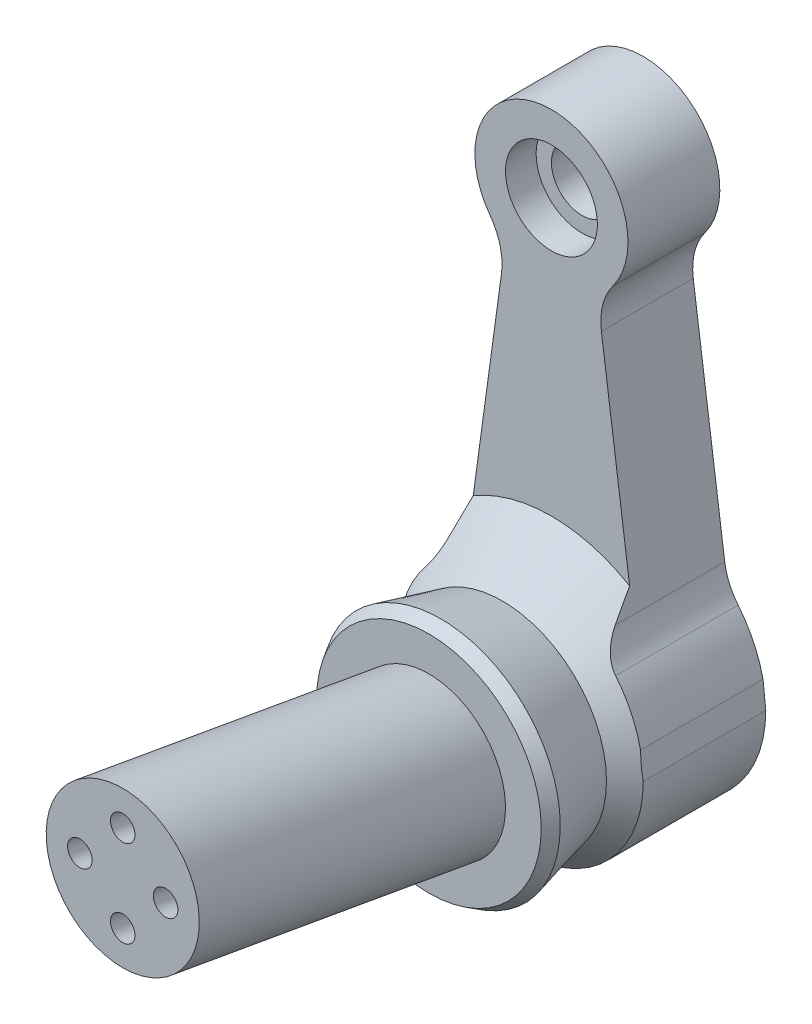
ISO-10303-21;
HEADER;
FILE_DESCRIPTION(('STEP AP214'),'2;1');
FILE_NAME('part.step','',(''),(''),'','','');
FILE_SCHEMA(('AUTOMOTIVE_DESIGN { 1 0 10303 214 1 1 1 1 }'));
ENDSEC;
DATA;
#1=APPLICATION_CONTEXT('core data for automotive mechanical design processes');
#2=APPLICATION_PROTOCOL_DEFINITION('international standard','automotive_design',2000,#1);
#3=PRODUCT_CONTEXT('',#1,'mechanical');
#4=PRODUCT('Part','Part','',(#3));
#5=PRODUCT_RELATED_PRODUCT_CATEGORY('part','',(#4));
#6=PRODUCT_DEFINITION_FORMATION('','',#4);
#7=PRODUCT_DEFINITION_CONTEXT('part definition',#1,'design');
#8=PRODUCT_DEFINITION('design','',#6,#7);
#9=PRODUCT_DEFINITION_SHAPE('','',#8);
#10=(LENGTH_UNIT() NAMED_UNIT(*) SI_UNIT(.MILLI.,.METRE.));
#11=(NAMED_UNIT(*) PLANE_ANGLE_UNIT() SI_UNIT($,.RADIAN.));
#12=(NAMED_UNIT(*) SI_UNIT($,.STERADIAN.) SOLID_ANGLE_UNIT());
#13=UNCERTAINTY_MEASURE_WITH_UNIT(LENGTH_MEASURE(1.E-05),#10,'distance_accuracy_value','');
#14=(GEOMETRIC_REPRESENTATION_CONTEXT(3) GLOBAL_UNCERTAINTY_ASSIGNED_CONTEXT((#13)) GLOBAL_UNIT_ASSIGNED_CONTEXT((#10,
#11,#12)) REPRESENTATION_CONTEXT('',''));
#15=CARTESIAN_POINT('',(0.,0.,0.));
#16=DIRECTION('',(0.,0.,1.));
#17=DIRECTION('',(1.,0.,0.));
#18=AXIS2_PLACEMENT_3D('',#15,#16,#17);
#19=CARTESIAN_POINT('',(0.,0.,-15.));
#20=DIRECTION('',(0.,0.,1.));
#21=DIRECTION('',(-1.,0.,0.));
#22=AXIS2_PLACEMENT_3D('',#19,#20,#21);
#23=CYLINDRICAL_SURFACE('',#22,4.);
#24=CARTESIAN_POINT('',(0.,0.,-15.));
#25=DIRECTION('',(0.,0.,1.));
#26=DIRECTION('',(1.,0.,0.));
#27=AXIS2_PLACEMENT_3D('',#24,#25,#26);
#28=CIRCLE('',#27,4.);
#29=CARTESIAN_POINT('',(4.,0.,-15.));
#30=VERTEX_POINT('',#29);
#31=EDGE_CURVE('E198',#30,#30,#28,.T.);
#32=ORIENTED_EDGE('',*,*,#31,.F.);
#33=EDGE_LOOP('',(#32));
#34=FACE_BOUND('',#33,.T.);
#35=CARTESIAN_POINT('',(0.,0.,-8.35500811345851));
#36=DIRECTION('',(0.,-0.173648177666931,-0.984807753012208));
#37=DIRECTION('',(0.,-0.984807753012208,0.173648177666931));
#38=AXIS2_PLACEMENT_3D('',#35,#36,#37);
#39=ELLIPSE('',#38,4.06170644754298,4.);
#40=CARTESIAN_POINT('',(0.,-4.,-7.64970019062464));
#41=VERTEX_POINT('',#40);
#42=EDGE_CURVE('E387',#41,#41,#39,.T.);
#43=ORIENTED_EDGE('',*,*,#42,.F.);
#44=EDGE_LOOP('',(#43));
#45=FACE_BOUND('',#44,.T.);
#46=ADVANCED_FACE('F39',(#34,#45),#23,.F.);
#47=CARTESIAN_POINT('',(0.,70.,-15.));
#48=DIRECTION('',(0.,0.,1.));
#49=DIRECTION('',(-1.,0.,0.));
#50=AXIS2_PLACEMENT_3D('',#47,#48,#49);
#51=CYLINDRICAL_SURFACE('',#50,5.);
#52=CARTESIAN_POINT('',(0.,70.,-5.));
#53=DIRECTION('',(0.,0.,-1.));
#54=DIRECTION('',(-1.,0.,0.));
#55=AXIS2_PLACEMENT_3D('',#52,#53,#54);
#56=CIRCLE('',#55,5.);
#57=CARTESIAN_POINT('',(-5.,70.,-5.));
#58=VERTEX_POINT('',#57);
#59=EDGE_CURVE('E203',#58,#58,#56,.T.);
#60=ORIENTED_EDGE('',*,*,#59,.F.);
#61=EDGE_LOOP('',(#60));
#62=FACE_BOUND('',#61,.T.);
#63=CARTESIAN_POINT('',(0.,70.,-10.));
#64=DIRECTION('',(0.,0.,1.));
#65=DIRECTION('',(1.,0.,0.));
#66=AXIS2_PLACEMENT_3D('',#63,#64,#65);
#67=CIRCLE('',#66,5.);
#68=CARTESIAN_POINT('',(5.,70.,-10.));
#69=VERTEX_POINT('',#68);
#70=EDGE_CURVE('E241',#69,#69,#67,.T.);
#71=ORIENTED_EDGE('',*,*,#70,.F.);
#72=EDGE_LOOP('',(#71));
#73=FACE_BOUND('',#72,.T.);
#74=ADVANCED_FACE('F339',(#62,#73),#51,.F.);
#75=CARTESIAN_POINT('',(-18.1547804490243,56.5584524287138,-15.));
#76=DIRECTION('',(0.,0.,1.));
#77=DIRECTION('',(-1.,0.,0.));
#78=AXIS2_PLACEMENT_3D('',#75,#76,#77);
#79=CYLINDRICAL_SURFACE('',#78,10.0891844532605);
#80=CARTESIAN_POINT('',(-18.1547804490243,56.5584524287138,0.));
#81=DIRECTION('',(0.,0.,1.));
#82=DIRECTION('',(1.,0.,0.));
#83=AXIS2_PLACEMENT_3D('',#80,#81,#82);
#84=CIRCLE('',#83,10.0891844532605);
#85=CARTESIAN_POINT('',(-8.15892713747916,55.1893068900712,0.));
#86=VERTEX_POINT('',#85);
#87=CARTESIAN_POINT('',(-10.0461686026052,62.5619561437143,0.));
#88=VERTEX_POINT('',#87);
#89=EDGE_CURVE('E201',#86,#88,#84,.T.);
#90=ORIENTED_EDGE('',*,*,#89,.T.);
#91=DIRECTION('',(0.,0.,1.));
#92=VECTOR('',#91,1.);
#93=CARTESIAN_POINT('',(-10.0461686026052,62.5619561437143,-15.));
#94=LINE('',#93,#92);
#95=CARTESIAN_POINT('',(-10.0461686026052,62.5619561437143,-15.));
#96=VERTEX_POINT('',#95);
#97=EDGE_CURVE('E166',#96,#88,#94,.T.);
#98=ORIENTED_EDGE('',*,*,#97,.F.);
#99=CARTESIAN_POINT('',(-18.1547804490243,56.5584524287138,-15.));
#100=DIRECTION('',(0.,0.,1.));
#101=DIRECTION('',(1.,0.,0.));
#102=AXIS2_PLACEMENT_3D('',#99,#100,#101);
#103=CIRCLE('',#102,10.0891844532605);
#104=CARTESIAN_POINT('',(-8.15892713747916,55.1893068900712,-15.));
#105=VERTEX_POINT('',#104);
#106=EDGE_CURVE('E144',#105,#96,#103,.T.);
#107=ORIENTED_EDGE('',*,*,#106,.F.);
#108=DIRECTION('',(0.,0.,1.));
#109=VECTOR('',#108,1.);
#110=CARTESIAN_POINT('',(-8.15892713747916,55.1893068900712,-15.));
#111=LINE('',#110,#109);
#112=EDGE_CURVE('E153',#105,#86,#111,.T.);
#113=ORIENTED_EDGE('',*,*,#112,.T.);
#114=EDGE_LOOP('',(#90,#98,#107,#113));
#115=FACE_BOUND('',#114,.T.);
#116=ADVANCED_FACE('F164',(#115),#79,.F.);
#117=CARTESIAN_POINT('',(-15.4288186971367,2.11330615079281,-15.));
#118=DIRECTION('',(-0.990749386915492,0.135704282639038,0.));
#119=DIRECTION('',(-0.135704282639038,-0.990749386915492,0.));
#120=AXIS2_PLACEMENT_3D('',#117,#118,#119);
#121=PLANE('',#120);
#122=DIRECTION('',(0.135704282639038,0.990749386915492,0.));
#123=VECTOR('',#122,1.);
#124=CARTESIAN_POINT('',(-15.4288186971367,2.11330615079281,0.));
#125=LINE('',#124,#123);
#126=CARTESIAN_POINT('',(-12.7748179780088,21.4896260002064,0.));
#127=VERTEX_POINT('',#126);
#128=EDGE_CURVE('E157',#127,#86,#125,.T.);
#129=ORIENTED_EDGE('',*,*,#128,.T.);
#130=ORIENTED_EDGE('',*,*,#112,.F.);
#131=DIRECTION('',(0.135704282639038,0.990749386915492,0.));
#132=VECTOR('',#131,1.);
#133=CARTESIAN_POINT('',(-15.4288186971367,2.11330615079281,-15.));
#134=LINE('',#133,#132);
#135=CARTESIAN_POINT('',(-13.2968460909897,17.6784048446871,-15.));
#136=VERTEX_POINT('',#135);
#137=EDGE_CURVE('E139',#136,#105,#134,.T.);
#138=ORIENTED_EDGE('',*,*,#137,.F.);
#139=DIRECTION('',(0.,0.,1.));
#140=VECTOR('',#139,1.);
#141=CARTESIAN_POINT('',(-13.2968460909897,17.6784048446871,-15.));
#142=LINE('',#141,#140);
#143=CARTESIAN_POINT('',(-13.2968460909897,17.6784048446871,2.87914753405465));
#144=VERTEX_POINT('',#143);
#145=EDGE_CURVE('E162',#136,#144,#142,.T.);
#146=ORIENTED_EDGE('',*,*,#145,.T.);
#147=CARTESIAN_POINT('',(-12.7748179780088,21.4896260002064,0.));
#148=CARTESIAN_POINT('',(-12.8176223789683,21.177119768397,0.246739229975935));
#149=CARTESIAN_POINT('',(-12.8605780259185,20.8635093203495,0.492061342454877));
#150=CARTESIAN_POINT('',(-12.9468210023197,20.2338668777264,0.979429768318582));
#151=CARTESIAN_POINT('',(-12.9901082870102,19.9178352099387,1.22147651198732));
#152=CARTESIAN_POINT('',(-13.0770561113179,19.2830468160038,1.70192408469994));
#153=CARTESIAN_POINT('',(-13.1207166598623,18.9642900246811,1.94032482616144));
#154=CARTESIAN_POINT('',(-13.20845750794,18.3237119253763,2.41298305002299));
#155=CARTESIAN_POINT('',(-13.2525378624421,18.0018902160782,2.64723997803675));
#156=CARTESIAN_POINT('',(-13.2968460909897,17.6784048446871,2.87914753405466));
#157=B_SPLINE_CURVE_WITH_KNOTS('',3,(#147,#148,#149,#150,#151,#152,#153,#154,#155,#156),
.UNSPECIFIED.,.F.,.F.,(4,2,2,2,4),(0.,1.20139915756858,2.40263892487455,3.60390750256063,
4.8053355964576),.UNSPECIFIED.);
#158=EDGE_CURVE('E249',#127,#144,#157,.T.);
#159=ORIENTED_EDGE('',*,*,#158,.F.);
#160=EDGE_LOOP('',(#129,#130,#138,#146,#159));
#161=FACE_BOUND('',#160,.T.);
#162=ADVANCED_FACE('F154',(#161),#121,.T.);
#163=CARTESIAN_POINT('',(-23.2926994025349,19.0475503833297,-15.));
#164=DIRECTION('',(0.,0.,1.));
#165=DIRECTION('',(-1.,0.,0.));
#166=AXIS2_PLACEMENT_3D('',#163,#164,#165);
#167=CYLINDRICAL_SURFACE('',#166,10.0891844532605);
#168=ORIENTED_EDGE('',*,*,#145,.F.);
#169=CARTESIAN_POINT('',(-23.2926994025349,19.0475503833297,-15.));
#170=DIRECTION('',(0.,0.,1.));
#171=DIRECTION('',(1.,0.,0.));
#172=AXIS2_PLACEMENT_3D('',#169,#170,#171);
#173=CIRCLE('',#172,10.0891844532605);
#174=CARTESIAN_POINT('',(-15.482439837289,12.6607289160114,-15.));
#175=VERTEX_POINT('',#174);
#176=EDGE_CURVE('E147',#136,#175,#173,.F.);
#177=ORIENTED_EDGE('',*,*,#176,.T.);
#178=DIRECTION('',(0.,0.,1.));
#179=VECTOR('',#178,1.);
#180=CARTESIAN_POINT('',(-15.482439837289,12.6607289160114,-15.));
#181=LINE('',#180,#179);
#182=CARTESIAN_POINT('',(-15.482439837289,12.6607289160114,5.00000000000012));
#183=VERTEX_POINT('',#182);
#184=EDGE_CURVE('E234',#175,#183,#181,.T.);
#185=ORIENTED_EDGE('',*,*,#184,.T.);
#186=CARTESIAN_POINT('',(-13.2968460909897,17.6784048446871,2.87914753405465));
#187=CARTESIAN_POINT('',(-13.3203113363246,17.507192998677,3.00185329834504));
#188=CARTESIAN_POINT('',(-13.348418038729,17.3346159370817,3.12189009438719));
#189=CARTESIAN_POINT('',(-13.4146355157064,16.986733279624,3.3555175306328));
#190=CARTESIAN_POINT('',(-13.4527585337191,16.8114245931737,3.4691000733846));
#191=CARTESIAN_POINT('',(-13.5404569033216,16.4553294182093,3.69037475216036));
#192=CARTESIAN_POINT('',(-13.5902258418407,16.2745011125449,3.79792426124837));
#193=CARTESIAN_POINT('',(-13.7015824396145,15.9109519114913,4.00318729808284));
#194=CARTESIAN_POINT('',(-13.7631662286491,15.7282316543448,4.10090403084052));
#195=CARTESIAN_POINT('',(-13.8995372101152,15.3598601384098,4.2854610559387));
#196=CARTESIAN_POINT('',(-13.9744391223138,15.1741973278878,4.37219462777658));
#197=CARTESIAN_POINT('',(-14.1376906586992,14.8027199404392,4.53148668419185));
#198=CARTESIAN_POINT('',(-14.2260354787702,14.6169054412239,4.60405021167397));
#199=CARTESIAN_POINT('',(-14.4157336910757,14.2482044982043,4.73213897769001));
#200=CARTESIAN_POINT('',(-14.5169680205905,14.0653066284189,4.78780609028709));
#201=CARTESIAN_POINT('',(-14.7328545769537,13.7029180659209,4.88073690044808));
#202=CARTESIAN_POINT('',(-14.8474939352861,13.5234242946785,4.91801807154868));
#203=CARTESIAN_POINT('',(-15.0486628412258,13.2296762436179,4.96336451999173));
#204=CARTESIAN_POINT('',(-15.1316417881057,13.113825866266,4.97704191134202));
#205=CARTESIAN_POINT('',(-15.3030748951882,12.8849101794305,4.99538940877769));
#206=CARTESIAN_POINT('',(-15.3915463714572,12.7718554315867,5.00002936200221));
#207=CARTESIAN_POINT('',(-15.482439837289,12.6607289160114,5.00000000000011));
#208=B_SPLINE_CURVE_WITH_KNOTS('',3,(#186,#187,#188,#189,#190,#191,#192,#193,#194,#195,#196,
#197,#198,#199,#200,#201,#202,#203,#204,#205,#206,#207),.UNSPECIFIED.,.F.,.F.,(4,2,2,2,2,2,2,2,
2,2,4),(0.,0.635869981673729,1.27252086439088,1.92061862869694,2.56850445537852,
3.22226827270938,3.87579899964796,4.52367990522281,5.17094388877604,5.60002554432336,
6.03053636877893),.UNSPECIFIED.);
#209=EDGE_CURVE('E257',#144,#183,#208,.T.);
#210=ORIENTED_EDGE('',*,*,#209,.F.);
#211=EDGE_LOOP('',(#168,#177,#185,#210));
#212=FACE_BOUND('',#211,.T.);
#213=ADVANCED_FACE('F329',(#212),#167,.F.);
#214=CARTESIAN_POINT('',(0.,0.,-15.));
#215=DIRECTION('',(0.,0.,1.));
#216=DIRECTION('',(-1.,0.,0.));
#217=AXIS2_PLACEMENT_3D('',#214,#215,#216);
#218=CYLINDRICAL_SURFACE('',#217,20.);
#219=ORIENTED_EDGE('',*,*,#184,.F.);
#220=CARTESIAN_POINT('',(0.,0.,-15.));
#221=DIRECTION('',(0.,0.,1.));
#222=DIRECTION('',(1.,0.,0.));
#223=AXIS2_PLACEMENT_3D('',#220,#221,#222);
#224=CIRCLE('',#223,20.);
#225=CARTESIAN_POINT('',(-19.5460277427491,4.23707440100882,-15.));
#226=VERTEX_POINT('',#225);
#227=EDGE_CURVE('E176',#175,#226,#224,.T.);
#228=ORIENTED_EDGE('',*,*,#227,.T.);
#229=DIRECTION('',(0.,0.,1.));
#230=VECTOR('',#229,1.);
#231=CARTESIAN_POINT('',(-19.5460277427491,4.23707440100882,-15.));
#232=LINE('',#231,#230);
#233=CARTESIAN_POINT('',(-19.5460277427491,4.23707440100882,5.00000000000012));
#234=VERTEX_POINT('',#233);
#235=EDGE_CURVE('E231',#226,#234,#232,.T.);
#236=ORIENTED_EDGE('',*,*,#235,.T.);
#237=CARTESIAN_POINT('',(0.,0.,5.00000000000012));
#238=DIRECTION('',(0.,0.,1.));
#239=DIRECTION('',(1.,0.,0.));
#240=AXIS2_PLACEMENT_3D('',#237,#238,#239);
#241=CIRCLE('',#240,20.);
#242=EDGE_CURVE('E378',#183,#234,#241,.T.);
#243=ORIENTED_EDGE('',*,*,#242,.F.);
#244=EDGE_LOOP('',(#219,#228,#236,#243));
#245=FACE_BOUND('',#244,.T.);
#246=ADVANCED_FACE('F317',(#245),#218,.T.);
#247=CARTESIAN_POINT('',(-19.7730138713745,2.11853720050442,-15.));
#248=DIRECTION('',(0.994309153919809,-0.106533123634266,0.));
#249=DIRECTION('',(0.106533123634266,0.994309153919809,0.));
#250=AXIS2_PLACEMENT_3D('',#247,#248,#249);
#251=PLANE('',#250);
#252=ORIENTED_EDGE('',*,*,#235,.F.);
#253=DIRECTION('',(-0.106533123634266,-0.994309153919809,0.));
#254=VECTOR('',#253,1.);
#255=CARTESIAN_POINT('',(-19.7730138713745,2.11853720050442,-15.));
#256=LINE('',#255,#254);
#257=CARTESIAN_POINT('',(-20.,0.,-15.));
#258=VERTEX_POINT('',#257);
#259=EDGE_CURVE('E179',#226,#258,#256,.T.);
#260=ORIENTED_EDGE('',*,*,#259,.T.);
#261=DIRECTION('',(0.,0.,1.));
#262=VECTOR('',#261,1.);
#263=CARTESIAN_POINT('',(-20.,0.,-15.));
#264=LINE('',#263,#262);
#265=CARTESIAN_POINT('',(-20.,0.,5.00000000000012));
#266=VERTEX_POINT('',#265);
#267=EDGE_CURVE('E228',#258,#266,#264,.T.);
#268=ORIENTED_EDGE('',*,*,#267,.T.);
#269=CARTESIAN_POINT('',(-19.5460277427491,4.23707440100883,5.00000000000012));
#270=CARTESIAN_POINT('',(-19.5837691591727,3.88482118105473,5.03780349483579));
#271=CARTESIAN_POINT('',(-19.6216182708556,3.53156280534808,5.06628494450402));
#272=CARTESIAN_POINT('',(-19.6973164154306,2.82504678931436,5.10426482263023));
#273=CARTESIAN_POINT('',(-19.7351651434026,2.47179199490939,5.11381692160394));
#274=CARTESIAN_POINT('',(-19.8108625993465,1.76528240609945,5.11381692160394));
#275=CARTESIAN_POINT('',(-19.8487113273184,1.41202761169448,5.10426482263023));
#276=CARTESIAN_POINT('',(-19.9244094718935,0.705511595660759,5.06628494450402));
#277=CARTESIAN_POINT('',(-19.9622585835763,0.352253219954116,5.03780349483579));
#278=CARTESIAN_POINT('',(-20.,0.,5.00000000000012));
#279=B_SPLINE_CURVE_WITH_KNOTS('',3,(#269,#270,#271,#272,#273,#274,#275,#276,#277,#278),
.UNSPECIFIED.,.F.,.F.,(4,2,2,2,4),(0.,1.06874411585868,2.13445365397183,3.20016319208498,
4.26890730794366),.UNSPECIFIED.);
#280=EDGE_CURVE('E278',#234,#266,#279,.T.);
#281=ORIENTED_EDGE('',*,*,#280,.F.);
#282=EDGE_LOOP('',(#252,#260,#268,#281));
#283=FACE_BOUND('',#282,.T.);
#284=ADVANCED_FACE('F324',(#283),#251,.F.);
#285=CARTESIAN_POINT('',(0.,0.,-15.));
#286=DIRECTION('',(0.,0.,1.));
#287=DIRECTION('',(-1.,0.,0.));
#288=AXIS2_PLACEMENT_3D('',#285,#286,#287);
#289=CYLINDRICAL_SURFACE('',#288,20.);
#290=ORIENTED_EDGE('',*,*,#267,.F.);
#291=CARTESIAN_POINT('',(0.,0.,-15.));
#292=DIRECTION('',(0.,0.,1.));
#293=DIRECTION('',(1.,0.,0.));
#294=AXIS2_PLACEMENT_3D('',#291,#292,#293);
#295=CIRCLE('',#294,20.);
#296=CARTESIAN_POINT('',(20.,0.,-15.));
#297=VERTEX_POINT('',#296);
#298=EDGE_CURVE('E183',#258,#297,#295,.T.);
#299=ORIENTED_EDGE('',*,*,#298,.T.);
#300=DIRECTION('',(0.,0.,1.));
#301=VECTOR('',#300,1.);
#302=CARTESIAN_POINT('',(20.,0.,-15.));
#303=LINE('',#302,#301);
#304=CARTESIAN_POINT('',(20.,0.,5.00000000000012));
#305=VERTEX_POINT('',#304);
#306=EDGE_CURVE('E225',#297,#305,#303,.T.);
#307=ORIENTED_EDGE('',*,*,#306,.T.);
#308=CARTESIAN_POINT('',(0.,0.,5.00000000000012));
#309=DIRECTION('',(0.,0.,1.));
#310=DIRECTION('',(1.,0.,0.));
#311=AXIS2_PLACEMENT_3D('',#308,#309,#310);
#312=CIRCLE('',#311,20.);
#313=EDGE_CURVE('E374',#266,#305,#312,.T.);
#314=ORIENTED_EDGE('',*,*,#313,.F.);
#315=EDGE_LOOP('',(#290,#299,#307,#314));
#316=FACE_BOUND('',#315,.T.);
#317=ADVANCED_FACE('F321',(#316),#289,.T.);
#318=CARTESIAN_POINT('',(19.7771968318702,2.09914794878004,-15.));
#319=DIRECTION('',(0.994414320891202,0.105546948826057,0.));
#320=DIRECTION('',(-0.105546948826057,0.994414320891202,0.));
#321=AXIS2_PLACEMENT_3D('',#318,#319,#320);
#322=PLANE('',#321);
#323=ORIENTED_EDGE('',*,*,#306,.F.);
#324=DIRECTION('',(0.105546948826057,-0.994414320891202,0.));
#325=VECTOR('',#324,1.);
#326=CARTESIAN_POINT('',(19.7771968318702,2.09914794878004,-15.));
#327=LINE('',#326,#325);
#328=CARTESIAN_POINT('',(19.5543936637404,4.19829589756008,-15.));
#329=VERTEX_POINT('',#328);
#330=EDGE_CURVE('E186',#329,#297,#327,.T.);
#331=ORIENTED_EDGE('',*,*,#330,.F.);
#332=DIRECTION('',(0.,0.,1.));
#333=VECTOR('',#332,1.);
#334=CARTESIAN_POINT('',(19.5543936637404,4.19829589756008,-15.));
#335=LINE('',#334,#333);
#336=CARTESIAN_POINT('',(19.5543936637404,4.19829589756008,5.00000000000012));
#337=VERTEX_POINT('',#336);
#338=EDGE_CURVE('E222',#329,#337,#335,.T.);
#339=ORIENTED_EDGE('',*,*,#338,.T.);
#340=CARTESIAN_POINT('',(20.,0.,5.00000000000012));
#341=CARTESIAN_POINT('',(19.9629524688026,0.349044628822953,5.03710735234064));
#342=CARTESIAN_POINT('',(19.9258011813893,0.699066800512326,5.06506196629304));
#343=CARTESIAN_POINT('',(19.8514986810307,1.39911044228909,5.10233922591236));
#344=CARTESIAN_POINT('',(19.8143477564505,1.74912919553456,5.11171358217609));
#345=CARTESIAN_POINT('',(19.7400459072899,2.44916670202551,5.11171358217609));
#346=CARTESIAN_POINT('',(19.7028949827097,2.79918545527099,5.10233922591236));
#347=CARTESIAN_POINT('',(19.6285924823511,3.49922909704775,5.06506196629304));
#348=CARTESIAN_POINT('',(19.5914411949378,3.84925126873712,5.03710735234064));
#349=CARTESIAN_POINT('',(19.5543936637404,4.19829589756008,5.00000000000012));
#350=B_SPLINE_CURVE_WITH_KNOTS('',3,(#340,#341,#342,#343,#344,#345,#346,#347,#348,#349),
.UNSPECIFIED.,.F.,.F.,(4,2,2,2,4),(0.,1.05878824067557,2.11462561359631,3.17046298651704,
4.22925122719261),.UNSPECIFIED.);
#351=EDGE_CURVE('E286',#305,#337,#350,.T.);
#352=ORIENTED_EDGE('',*,*,#351,.F.);
#353=EDGE_LOOP('',(#323,#331,#339,#352));
#354=FACE_BOUND('',#353,.T.);
#355=ADVANCED_FACE('F315',(#354),#322,.T.);
#356=ORIENTED_EDGE('',*,*,#338,.F.);
#357=CARTESIAN_POINT('',(15.482439837289,12.6607289160114,-15.));
#358=VERTEX_POINT('',#357);
#359=EDGE_CURVE('E180',#329,#358,#224,.T.);
#360=ORIENTED_EDGE('',*,*,#359,.T.);
#361=DIRECTION('',(0.,0.,1.));
#362=VECTOR('',#361,1.);
#363=CARTESIAN_POINT('',(15.482439837289,12.6607289160114,-15.));
#364=LINE('',#363,#362);
#365=CARTESIAN_POINT('',(15.482439837289,12.6607289160114,5.00000000000012));
#366=VERTEX_POINT('',#365);
#367=EDGE_CURVE('E219',#358,#366,#364,.T.);
#368=ORIENTED_EDGE('',*,*,#367,.T.);
#369=CARTESIAN_POINT('',(0.,0.,5.00000000000012));
#370=DIRECTION('',(0.,0.,1.));
#371=DIRECTION('',(1.,0.,0.));
#372=AXIS2_PLACEMENT_3D('',#369,#370,#371);
#373=CIRCLE('',#372,20.);
#374=EDGE_CURVE('E299',#337,#366,#373,.T.);
#375=ORIENTED_EDGE('',*,*,#374,.F.);
#376=EDGE_LOOP('',(#356,#360,#368,#375));
#377=FACE_BOUND('',#376,.T.);
#378=ADVANCED_FACE('F311',(#377),#218,.T.);
#379=CARTESIAN_POINT('',(23.2926994025349,19.0475503833297,-15.));
#380=DIRECTION('',(0.,0.,1.));
#381=DIRECTION('',(-1.,0.,0.));
#382=AXIS2_PLACEMENT_3D('',#379,#380,#381);
#383=CYLINDRICAL_SURFACE('',#382,10.0891844532605);
#384=ORIENTED_EDGE('',*,*,#367,.F.);
#385=CARTESIAN_POINT('',(23.2926994025349,19.0475503833297,-15.));
#386=DIRECTION('',(0.,0.,1.));
#387=DIRECTION('',(1.,0.,0.));
#388=AXIS2_PLACEMENT_3D('',#385,#386,#387);
#389=CIRCLE('',#388,10.0891844532605);
#390=CARTESIAN_POINT('',(13.2968460909897,17.6784048446871,-15.));
#391=VERTEX_POINT('',#390);
#392=EDGE_CURVE('E188',#391,#358,#389,.T.);
#393=ORIENTED_EDGE('',*,*,#392,.F.);
#394=DIRECTION('',(0.,0.,1.));
#395=VECTOR('',#394,1.);
#396=CARTESIAN_POINT('',(13.2968460909897,17.6784048446871,-15.));
#397=LINE('',#396,#395);
#398=CARTESIAN_POINT('',(13.2968460909897,17.6784048446871,2.87914753405466));
#399=VERTEX_POINT('',#398);
#400=EDGE_CURVE('E217',#391,#399,#397,.T.);
#401=ORIENTED_EDGE('',*,*,#400,.T.);
#402=CARTESIAN_POINT('',(15.482439837289,12.6607289160114,5.00000000000012));
#403=CARTESIAN_POINT('',(15.3744633189293,12.7927122872911,5.00006784378373));
#404=CARTESIAN_POINT('',(15.2699146692797,12.9274466761248,4.99349843459925));
#405=CARTESIAN_POINT('',(15.0684110729079,13.2010677304875,4.96760456343457));
#406=CARTESIAN_POINT('',(14.9714476361966,13.339949506088,4.9482945970027));
#407=CARTESIAN_POINT('',(14.7866844337131,13.6191884207817,4.89773249013648));
#408=CARTESIAN_POINT('',(14.6987912524226,13.7595096459621,4.8666217718696));
#409=CARTESIAN_POINT('',(14.5311633079929,14.0421404454945,4.79329900900041));
#410=CARTESIAN_POINT('',(14.4514311537442,14.1844506392521,4.75108342973364));
#411=CARTESIAN_POINT('',(14.2807451193202,14.506887752298,4.64436919699682));
#412=CARTESIAN_POINT('',(14.1921902149505,14.6873142474202,4.57693177559288));
#413=CARTESIAN_POINT('',(14.0278445458507,15.0483621780927,4.42818056381973));
#414=CARTESIAN_POINT('',(13.9520635281042,15.2289836576135,4.34685627160694));
#415=CARTESIAN_POINT('',(13.812390759424,15.5902240084695,4.17196146495211));
#416=CARTESIAN_POINT('',(13.7485671067861,15.7708373365952,4.07832568627474));
#417=CARTESIAN_POINT('',(13.6326446859741,16.1302523766667,3.88109529632069));
#418=CARTESIAN_POINT('',(13.5805422571589,16.3090546375185,3.77750380876428));
#419=CARTESIAN_POINT('',(13.4807448236808,16.6893504701465,3.54688796549757));
#420=CARTESIAN_POINT('',(13.4346912382571,16.8905117270435,3.41861433448293));
#421=CARTESIAN_POINT('',(13.3561233730477,17.2878284228407,3.15435865451205));
#422=CARTESIAN_POINT('',(13.3234944503096,17.4840122261331,3.01845364075938));
#423=CARTESIAN_POINT('',(13.2968460909897,17.6784048446871,2.87914753405465));
#424=B_SPLINE_CURVE_WITH_KNOTS('',3,(#402,#403,#404,#405,#406,#407,#408,#409,#410,#411,#412,
#413,#414,#415,#416,#417,#418,#419,#420,#421,#422,#423),.UNSPECIFIED.,.F.,.F.,(4,2,2,2,2,2,2,2,
2,2,4),(0.,0.5113263973712,1.0220720348428,1.526880879412,2.03185059889083,2.66688098537153,
3.30239375313177,3.94142256417353,4.58025152299736,5.3086231684363,6.03063872072527),.UNSPECIFIED.);
#425=EDGE_CURVE('E63',#366,#399,#424,.T.);
#426=ORIENTED_EDGE('',*,*,#425,.F.);
#427=EDGE_LOOP('',(#384,#393,#401,#426));
#428=FACE_BOUND('',#427,.T.);
#429=ADVANCED_FACE('F306',(#428),#383,.F.);
#430=CARTESIAN_POINT('',(15.4288186971367,2.11330615079281,-15.));
#431=DIRECTION('',(-0.990749386915492,-0.135704282639038,0.));
#432=DIRECTION('',(0.135704282639038,-0.990749386915492,0.));
#433=AXIS2_PLACEMENT_3D('',#430,#431,#432);
#434=PLANE('',#433);
#435=ORIENTED_EDGE('',*,*,#400,.F.);
#436=DIRECTION('',(-0.135704282639038,0.990749386915492,0.));
#437=VECTOR('',#436,1.);
#438=CARTESIAN_POINT('',(15.4288186971367,2.11330615079281,-15.));
#439=LINE('',#438,#437);
#440=CARTESIAN_POINT('',(8.15892713747916,55.1893068900712,-15.));
#441=VERTEX_POINT('',#440);
#442=EDGE_CURVE('E190',#391,#441,#439,.T.);
#443=ORIENTED_EDGE('',*,*,#442,.T.);
#444=DIRECTION('',(0.,0.,1.));
#445=VECTOR('',#444,1.);
#446=CARTESIAN_POINT('',(8.15892713747916,55.1893068900712,-15.));
#447=LINE('',#446,#445);
#448=CARTESIAN_POINT('',(8.15892713747916,55.1893068900712,0.));
#449=VERTEX_POINT('',#448);
#450=EDGE_CURVE('E214',#441,#449,#447,.T.);
#451=ORIENTED_EDGE('',*,*,#450,.T.);
#452=DIRECTION('',(-0.135704282639038,0.990749386915492,0.));
#453=VECTOR('',#452,1.);
#454=CARTESIAN_POINT('',(15.4288186971367,2.11330615079281,0.));
#455=LINE('',#454,#453);
#456=CARTESIAN_POINT('',(12.7748179780088,21.4896260002064,0.));
#457=VERTEX_POINT('',#456);
#458=EDGE_CURVE('E205',#457,#449,#455,.T.);
#459=ORIENTED_EDGE('',*,*,#458,.F.);
#460=CARTESIAN_POINT('',(13.2968460909897,17.6784048446871,2.87914753405466));
#461=CARTESIAN_POINT('',(13.2525378624421,18.0018902160782,2.64723997803675));
#462=CARTESIAN_POINT('',(13.20845750794,18.3237119253763,2.41298305002299));
#463=CARTESIAN_POINT('',(13.1207166598623,18.9642900246811,1.94032482616144));
#464=CARTESIAN_POINT('',(13.0770561113179,19.2830468160038,1.70192408469994));
#465=CARTESIAN_POINT('',(12.9901082870102,19.9178352099387,1.22147651198731));
#466=CARTESIAN_POINT('',(12.9468210023197,20.2338668777264,0.979429768318581));
#467=CARTESIAN_POINT('',(12.8605780259185,20.8635093203495,0.492061342454876));
#468=CARTESIAN_POINT('',(12.8176223789683,21.177119768397,0.246739229975934));
#469=CARTESIAN_POINT('',(12.7748179780088,21.4896260002064,0.));
#470=B_SPLINE_CURVE_WITH_KNOTS('',3,(#460,#461,#462,#463,#464,#465,#466,#467,#468,#469),
.UNSPECIFIED.,.F.,.F.,(4,2,2,2,4),(0.,1.20142809389697,2.40269667158305,3.60393643888901,
4.8053355964576),.UNSPECIFIED.);
#471=EDGE_CURVE('E56',#399,#457,#470,.T.);
#472=ORIENTED_EDGE('',*,*,#471,.F.);
#473=EDGE_LOOP('',(#435,#443,#451,#459,#472));
#474=FACE_BOUND('',#473,.T.);
#475=ADVANCED_FACE('F310',(#474),#434,.F.);
#476=CARTESIAN_POINT('',(18.1547804490243,56.5584524287138,-15.));
#477=DIRECTION('',(0.,0.,1.));
#478=DIRECTION('',(-1.,0.,0.));
#479=AXIS2_PLACEMENT_3D('',#476,#477,#478);
#480=CYLINDRICAL_SURFACE('',#479,10.0891844532605);
#481=CARTESIAN_POINT('',(18.1547804490243,56.5584524287138,0.));
#482=DIRECTION('',(0.,0.,1.));
#483=DIRECTION('',(1.,0.,0.));
#484=AXIS2_PLACEMENT_3D('',#481,#482,#483);
#485=CIRCLE('',#484,10.0891844532605);
#486=CARTESIAN_POINT('',(10.0461686026052,62.5619561437143,0.));
#487=VERTEX_POINT('',#486);
#488=EDGE_CURVE('E169',#449,#487,#485,.F.);
#489=ORIENTED_EDGE('',*,*,#488,.F.);
#490=ORIENTED_EDGE('',*,*,#450,.F.);
#491=CARTESIAN_POINT('',(18.1547804490243,56.5584524287138,-15.));
#492=DIRECTION('',(0.,0.,1.));
#493=DIRECTION('',(1.,0.,0.));
#494=AXIS2_PLACEMENT_3D('',#491,#492,#493);
#495=CIRCLE('',#494,10.0891844532605);
#496=CARTESIAN_POINT('',(10.0461686026052,62.5619561437143,-15.));
#497=VERTEX_POINT('',#496);
#498=EDGE_CURVE('E193',#441,#497,#495,.F.);
#499=ORIENTED_EDGE('',*,*,#498,.T.);
#500=DIRECTION('',(0.,0.,1.));
#501=VECTOR('',#500,1.);
#502=CARTESIAN_POINT('',(10.0461686026052,62.5619561437143,-15.));
#503=LINE('',#502,#501);
#504=EDGE_CURVE('E211',#497,#487,#503,.T.);
#505=ORIENTED_EDGE('',*,*,#504,.T.);
#506=EDGE_LOOP('',(#489,#490,#499,#505));
#507=FACE_BOUND('',#506,.T.);
#508=ADVANCED_FACE('F355',(#507),#480,.F.);
#509=CARTESIAN_POINT('',(0.,70.,-15.));
#510=DIRECTION('',(0.,0.,1.));
#511=DIRECTION('',(-1.,0.,0.));
#512=AXIS2_PLACEMENT_3D('',#509,#510,#511);
#513=CYLINDRICAL_SURFACE('',#512,12.5);
#514=CARTESIAN_POINT('',(0.,70.,0.));
#515=DIRECTION('',(0.,0.,1.));
#516=DIRECTION('',(1.,0.,0.));
#517=AXIS2_PLACEMENT_3D('',#514,#515,#516);
#518=CIRCLE('',#517,12.5);
#519=EDGE_CURVE('E167',#487,#88,#518,.T.);
#520=ORIENTED_EDGE('',*,*,#519,.F.);
#521=ORIENTED_EDGE('',*,*,#504,.F.);
#522=CARTESIAN_POINT('',(0.,70.,-15.));
#523=DIRECTION('',(0.,0.,1.));
#524=DIRECTION('',(1.,0.,0.));
#525=AXIS2_PLACEMENT_3D('',#522,#523,#524);
#526=CIRCLE('',#525,12.5);
#527=EDGE_CURVE('E196',#497,#96,#526,.T.);
#528=ORIENTED_EDGE('',*,*,#527,.T.);
#529=ORIENTED_EDGE('',*,*,#97,.T.);
#530=EDGE_LOOP('',(#520,#521,#528,#529));
#531=FACE_BOUND('',#530,.T.);
#532=ADVANCED_FACE('F353',(#531),#513,.T.);
#533=CARTESIAN_POINT('',(0.,0.,-15.));
#534=DIRECTION('',(0.,0.,-1.));
#535=DIRECTION('',(1.,0.,0.));
#536=AXIS2_PLACEMENT_3D('',#533,#534,#535);
#537=PLANE('',#536);
#538=CARTESIAN_POINT('',(0.,70.,-15.));
#539=DIRECTION('',(0.,0.,1.));
#540=DIRECTION('',(1.,0.,0.));
#541=AXIS2_PLACEMENT_3D('',#538,#539,#540);
#542=CIRCLE('',#541,7.5);
#543=CARTESIAN_POINT('',(7.5,70.,-15.));
#544=VERTEX_POINT('',#543);
#545=EDGE_CURVE('E390',#544,#544,#542,.T.);
#546=ORIENTED_EDGE('',*,*,#545,.T.);
#547=EDGE_LOOP('',(#546));
#548=FACE_BOUND('',#547,.T.);
#549=ORIENTED_EDGE('',*,*,#106,.T.);
#550=ORIENTED_EDGE('',*,*,#527,.F.);
#551=ORIENTED_EDGE('',*,*,#498,.F.);
#552=ORIENTED_EDGE('',*,*,#442,.F.);
#553=ORIENTED_EDGE('',*,*,#392,.T.);
#554=ORIENTED_EDGE('',*,*,#359,.F.);
#555=ORIENTED_EDGE('',*,*,#330,.T.);
#556=ORIENTED_EDGE('',*,*,#298,.F.);
#557=ORIENTED_EDGE('',*,*,#259,.F.);
#558=ORIENTED_EDGE('',*,*,#227,.F.);
#559=ORIENTED_EDGE('',*,*,#176,.F.);
#560=ORIENTED_EDGE('',*,*,#137,.T.);
#561=EDGE_LOOP('',(#549,#550,#551,#552,#553,#554,#555,#556,#557,#558,#559,#560));
#562=FACE_BOUND('',#561,.T.);
#563=ORIENTED_EDGE('',*,*,#31,.T.);
#564=EDGE_LOOP('',(#563));
#565=FACE_BOUND('',#564,.T.);
#566=ADVANCED_FACE('F141',(#548,#562,#565),#537,.T.);
#567=CARTESIAN_POINT('',(0.,0.,0.));
#568=DIRECTION('',(0.,0.,-1.));
#569=DIRECTION('',(1.,0.,0.));
#570=AXIS2_PLACEMENT_3D('',#567,#568,#569);
#571=PLANE('',#570);
#572=CARTESIAN_POINT('',(0.,70.,0.));
#573=DIRECTION('',(0.,0.,-1.));
#574=DIRECTION('',(-1.,0.,0.));
#575=AXIS2_PLACEMENT_3D('',#572,#573,#574);
#576=CIRCLE('',#575,7.5);
#577=CARTESIAN_POINT('',(-7.5,70.,0.));
#578=VERTEX_POINT('',#577);
#579=EDGE_CURVE('E172',#578,#578,#576,.T.);
#580=ORIENTED_EDGE('',*,*,#579,.T.);
#581=EDGE_LOOP('',(#580));
#582=FACE_BOUND('',#581,.T.);
#583=ORIENTED_EDGE('',*,*,#458,.T.);
#584=ORIENTED_EDGE('',*,*,#488,.T.);
#585=ORIENTED_EDGE('',*,*,#519,.T.);
#586=ORIENTED_EDGE('',*,*,#89,.F.);
#587=ORIENTED_EDGE('',*,*,#128,.F.);
#588=CARTESIAN_POINT('',(0.,0.,0.));
#589=DIRECTION('',(0.,0.,1.));
#590=DIRECTION('',(1.,0.,0.));
#591=AXIS2_PLACEMENT_3D('',#588,#589,#590);
#592=CIRCLE('',#591,25.0000000000001);
#593=EDGE_CURVE('E247',#457,#127,#592,.T.);
#594=ORIENTED_EDGE('',*,*,#593,.F.);
#595=EDGE_LOOP('',(#583,#584,#585,#586,#587,#594));
#596=FACE_BOUND('',#595,.T.);
#597=ADVANCED_FACE('F350',(#582,#596),#571,.F.);
#598=CARTESIAN_POINT('',(0.,70.,-5.));
#599=DIRECTION('',(0.,0.,1.));
#600=DIRECTION('',(-1.,0.,0.));
#601=AXIS2_PLACEMENT_3D('',#598,#599,#600);
#602=CYLINDRICAL_SURFACE('',#601,7.5);
#603=CARTESIAN_POINT('',(0.,70.,-5.));
#604=DIRECTION('',(0.,0.,-1.));
#605=DIRECTION('',(-1.,0.,0.));
#606=AXIS2_PLACEMENT_3D('',#603,#604,#605);
#607=CIRCLE('',#606,7.5);
#608=CARTESIAN_POINT('',(-7.5,70.,-5.));
#609=VERTEX_POINT('',#608);
#610=EDGE_CURVE('E240',#609,#609,#607,.T.);
#611=ORIENTED_EDGE('',*,*,#610,.T.);
#612=EDGE_LOOP('',(#611));
#613=FACE_BOUND('',#612,.T.);
#614=ORIENTED_EDGE('',*,*,#579,.F.);
#615=EDGE_LOOP('',(#614));
#616=FACE_BOUND('',#615,.T.);
#617=ADVANCED_FACE('F407',(#613,#616),#602,.F.);
#618=CARTESIAN_POINT('',(0.,70.,-5.));
#619=DIRECTION('',(0.,0.,1.));
#620=DIRECTION('',(-1.,0.,0.));
#621=AXIS2_PLACEMENT_3D('',#618,#619,#620);
#622=PLANE('',#621);
#623=ORIENTED_EDGE('',*,*,#59,.T.);
#624=EDGE_LOOP('',(#623));
#625=FACE_BOUND('',#624,.T.);
#626=ORIENTED_EDGE('',*,*,#610,.F.);
#627=EDGE_LOOP('',(#626));
#628=FACE_BOUND('',#627,.T.);
#629=ADVANCED_FACE('F409',(#625,#628),#622,.T.);
#630=CARTESIAN_POINT('',(0.,70.,-10.));
#631=DIRECTION('',(0.,0.,-1.));
#632=DIRECTION('',(1.,0.,0.));
#633=AXIS2_PLACEMENT_3D('',#630,#631,#632);
#634=CYLINDRICAL_SURFACE('',#633,7.5);
#635=CARTESIAN_POINT('',(0.,70.,-10.));
#636=DIRECTION('',(0.,0.,1.));
#637=DIRECTION('',(1.,0.,0.));
#638=AXIS2_PLACEMENT_3D('',#635,#636,#637);
#639=CIRCLE('',#638,7.5);
#640=CARTESIAN_POINT('',(7.5,70.,-10.));
#641=VERTEX_POINT('',#640);
#642=EDGE_CURVE('E244',#641,#641,#639,.T.);
#643=ORIENTED_EDGE('',*,*,#642,.T.);
#644=EDGE_LOOP('',(#643));
#645=FACE_BOUND('',#644,.T.);
#646=ORIENTED_EDGE('',*,*,#545,.F.);
#647=EDGE_LOOP('',(#646));
#648=FACE_BOUND('',#647,.T.);
#649=ADVANCED_FACE('F415',(#645,#648),#634,.F.);
#650=CARTESIAN_POINT('',(0.,70.,-10.));
#651=DIRECTION('',(0.,0.,-1.));
#652=DIRECTION('',(1.,0.,0.));
#653=AXIS2_PLACEMENT_3D('',#650,#651,#652);
#654=PLANE('',#653);
#655=ORIENTED_EDGE('',*,*,#70,.T.);
#656=EDGE_LOOP('',(#655));
#657=FACE_BOUND('',#656,.T.);
#658=ORIENTED_EDGE('',*,*,#642,.F.);
#659=EDGE_LOOP('',(#658));
#660=FACE_BOUND('',#659,.T.);
#661=ADVANCED_FACE('F447',(#657,#660),#654,.T.);
#662=CARTESIAN_POINT('',(0.,0.,20.));
#663=DIRECTION('',(0.,0.,1.));
#664=DIRECTION('',(-1.,0.,0.));
#665=AXIS2_PLACEMENT_3D('',#662,#663,#664);
#666=PLANE('',#665);
#667=CARTESIAN_POINT('',(0.,0.,20.));
#668=DIRECTION('',(0.,0.,-1.));
#669=DIRECTION('',(0.,-1.,0.));
#670=AXIS2_PLACEMENT_3D('',#667,#668,#669);
#671=ELLIPSE('',#670,12.6928326485718,12.5);
#672=CARTESIAN_POINT('',(0.,-12.6928326485718,20.));
#673=VERTEX_POINT('',#672);
#674=EDGE_CURVE('E385',#673,#673,#671,.F.);
#675=ORIENTED_EDGE('',*,*,#674,.F.);
#676=EDGE_LOOP('',(#675));
#677=FACE_BOUND('',#676,.T.);
#678=CARTESIAN_POINT('',(0.,0.,20.));
#679=DIRECTION('',(0.,0.,-1.));
#680=DIRECTION('',(-1.,0.,0.));
#681=AXIS2_PLACEMENT_3D('',#678,#679,#680);
#682=CIRCLE('',#681,18.3366912842043);
#683=CARTESIAN_POINT('',(18.3366912842043,0.,20.));
#684=VERTEX_POINT('',#683);
#685=EDGE_CURVE('E48',#684,#684,#682,.T.);
#686=ORIENTED_EDGE('',*,*,#685,.F.);
#687=EDGE_LOOP('',(#686));
#688=FACE_BOUND('',#687,.T.);
#689=ADVANCED_FACE('F456',(#677,#688),#666,.T.);
#690=CARTESIAN_POINT('',(0.,0.,0.));
#691=DIRECTION('',(0.,0.,1.));
#692=DIRECTION('',(-1.,0.,0.));
#693=AXIS2_PLACEMENT_3D('',#690,#691,#692);
#694=CONICAL_SURFACE('',#693,15.,0.244346095279207);
#695=CARTESIAN_POINT('',(0.,0.,18.059408547448));
#696=DIRECTION('',(0.,0.,-1.));
#697=DIRECTION('',(-1.,0.,0.));
#698=AXIS2_PLACEMENT_3D('',#695,#696,#697);
#699=CIRCLE('',#698,19.5027162656643);
#700=CARTESIAN_POINT('',(19.5027162656643,0.,18.059408547448));
#701=VERTEX_POINT('',#700);
#702=EDGE_CURVE('E11',#701,#701,#699,.F.);
#703=ORIENTED_EDGE('',*,*,#702,.F.);
#704=EDGE_LOOP('',(#703));
#705=FACE_BOUND('',#704,.T.);
#706=CARTESIAN_POINT('',(0.,0.,8.00430309513792));
#707=DIRECTION('',(0.,0.,-1.));
#708=DIRECTION('',(-1.,0.,0.));
#709=AXIS2_PLACEMENT_3D('',#706,#707,#708);
#710=CIRCLE('',#709,16.9956969048622);
#711=CARTESIAN_POINT('',(-16.9956969048622,0.,8.00430309513792));
#712=VERTEX_POINT('',#711);
#713=EDGE_CURVE('E161',#712,#712,#710,.T.);
#714=ORIENTED_EDGE('',*,*,#713,.F.);
#715=EDGE_LOOP('',(#714));
#716=FACE_BOUND('',#715,.T.);
#717=ADVANCED_FACE('F269',(#705,#716),#694,.T.);
#718=CARTESIAN_POINT('',(0.,0.,8.00430309513792));
#719=DIRECTION('',(0.,0.,-1.));
#720=DIRECTION('',(1.,0.,0.));
#721=AXIS2_PLACEMENT_3D('',#718,#719,#720);
#722=CONICAL_SURFACE('',#721,16.9956969048622,0.785398163397442);
#723=ORIENTED_EDGE('',*,*,#158,.T.);
#724=ORIENTED_EDGE('',*,*,#209,.T.);
#725=ORIENTED_EDGE('',*,*,#242,.T.);
#726=ORIENTED_EDGE('',*,*,#280,.T.);
#727=ORIENTED_EDGE('',*,*,#313,.T.);
#728=ORIENTED_EDGE('',*,*,#351,.T.);
#729=ORIENTED_EDGE('',*,*,#374,.T.);
#730=ORIENTED_EDGE('',*,*,#425,.T.);
#731=ORIENTED_EDGE('',*,*,#471,.T.);
#732=ORIENTED_EDGE('',*,*,#593,.T.);
#733=EDGE_LOOP('',(#723,#724,#725,#726,#727,#728,#729,#730,#731,#732));
#734=FACE_BOUND('',#733,.T.);
#735=ORIENTED_EDGE('',*,*,#713,.T.);
#736=EDGE_LOOP('',(#735));
#737=FACE_BOUND('',#736,.T.);
#738=ADVANCED_FACE('F266',(#734,#737),#722,.T.);
#739=CARTESIAN_POINT('',(0.,0.,20.));
#740=DIRECTION('',(0.,0.,-1.));
#741=DIRECTION('',(1.,0.,0.));
#742=AXIS2_PLACEMENT_3D('',#739,#740,#741);
#743=CONICAL_SURFACE('',#742,18.3366912842043,0.541052068118243);
#744=CARTESIAN_POINT('',(19.5027162656643,0.,18.059408547448));
#745=CARTESIAN_POINT('',(19.4905701721074,0.,18.0796230417454));
#746=CARTESIAN_POINT('',(19.4784240785505,0.,18.0998375360428));
#747=CARTESIAN_POINT('',(19.4541318914368,0.,18.1402665246377));
#748=CARTESIAN_POINT('',(19.4419857978799,0.,18.1604810189351));
#749=CARTESIAN_POINT('',(19.4176936107662,0.,18.2009100075299));
#750=CARTESIAN_POINT('',(19.4055475172093,0.,18.2211245018273));
#751=CARTESIAN_POINT('',(19.3812553300955,0.,18.2615534904222));
#752=CARTESIAN_POINT('',(19.3691092365387,0.,18.2817679847196));
#753=CARTESIAN_POINT('',(19.3448170494249,0.,18.3221969733144));
#754=CARTESIAN_POINT('',(19.332670955868,0.,18.3424114676118));
#755=CARTESIAN_POINT('',(19.3083787687543,0.,18.3828404562067));
#756=CARTESIAN_POINT('',(19.2962326751974,0.,18.4030549505041));
#757=CARTESIAN_POINT('',(19.2719404880837,0.,18.4434839390989));
#758=CARTESIAN_POINT('',(19.2597943945268,0.,18.4636984333963));
#759=CARTESIAN_POINT('',(19.235502207413,0.,18.5041274219912));
#760=CARTESIAN_POINT('',(19.2233561138562,0.,18.5243419162886));
#761=CARTESIAN_POINT('',(19.1990639267424,0.,18.5647709048834));
#762=CARTESIAN_POINT('',(19.1869178331855,0.,18.5849853991808));
#763=CARTESIAN_POINT('',(19.1626256460718,0.,18.6254143877757));
#764=CARTESIAN_POINT('',(19.1504795525149,0.,18.6456288820731));
#765=CARTESIAN_POINT('',(19.1261873654012,0.,18.6860578706679));
#766=CARTESIAN_POINT('',(19.1140412718443,0.,18.7062723649653));
#767=CARTESIAN_POINT('',(19.0897490847305,0.,18.7467013535602));
#768=CARTESIAN_POINT('',(19.0776029911737,0.,18.7669158478576));
#769=CARTESIAN_POINT('',(19.0533108040599,0.,18.8073448364524));
#770=CARTESIAN_POINT('',(19.041164710503,0.,18.8275593307498));
#771=CARTESIAN_POINT('',(19.0168725233893,0.,18.8679883193447));
#772=CARTESIAN_POINT('',(19.0047264298324,0.,18.8882028136421));
#773=CARTESIAN_POINT('',(18.9804342427187,0.,18.9286318022369));
#774=CARTESIAN_POINT('',(18.9682881491618,0.,18.9488462965343));
#775=CARTESIAN_POINT('',(18.943995962048,0.,18.9892752851292));
#776=CARTESIAN_POINT('',(18.9318498684912,0.,19.0094897794266));
#777=CARTESIAN_POINT('',(18.9075576813774,0.,19.0499187680214));
#778=CARTESIAN_POINT('',(18.8954115878205,0.,19.0701332623188));
#779=CARTESIAN_POINT('',(18.8711194007068,0.,19.1105622509137));
#780=CARTESIAN_POINT('',(18.8589733071499,0.,19.1307767452111));
#781=CARTESIAN_POINT('',(18.8346811200362,0.,19.1712057338059));
#782=CARTESIAN_POINT('',(18.8225350264793,0.,19.1914202281033));
#783=CARTESIAN_POINT('',(18.7982428393655,0.,19.2318492166982));
#784=CARTESIAN_POINT('',(18.7860967458087,0.,19.2520637109956));
#785=CARTESIAN_POINT('',(18.7618045586949,0.,19.2924926995904));
#786=CARTESIAN_POINT('',(18.749658465138,0.,19.3127071938878));
#787=CARTESIAN_POINT('',(18.7253662780243,0.,19.3531361824827));
#788=CARTESIAN_POINT('',(18.7132201844674,0.,19.3733506767801));
#789=CARTESIAN_POINT('',(18.6889279973537,0.,19.4137796653749));
#790=CARTESIAN_POINT('',(18.6767819037968,0.,19.4339941596723));
#791=CARTESIAN_POINT('',(18.652489716683,0.,19.4744231482672));
#792=CARTESIAN_POINT('',(18.6403436231262,0.,19.4946376425646));
#793=CARTESIAN_POINT('',(18.6160514360124,0.,19.5350666311594));
#794=CARTESIAN_POINT('',(18.6039053424556,0.,19.5552811254568));
#795=CARTESIAN_POINT('',(18.5796131553418,0.,19.5957101140517));
#796=CARTESIAN_POINT('',(18.5674670617849,0.,19.6159246083491));
#797=CARTESIAN_POINT('',(18.5431748746712,0.,19.6563535969439));
#798=CARTESIAN_POINT('',(18.5310287811143,0.,19.6765680912413));
#799=CARTESIAN_POINT('',(18.5067365940006,0.,19.7169970798362));
#800=CARTESIAN_POINT('',(18.4945905004437,0.,19.7372115741336));
#801=CARTESIAN_POINT('',(18.4702983133299,0.,19.7776405627284));
#802=CARTESIAN_POINT('',(18.4581522197731,0.,19.7978550570258));
#803=CARTESIAN_POINT('',(18.4338600326593,0.,19.8382840456207));
#804=CARTESIAN_POINT('',(18.4217139391024,0.,19.8584985399181));
#805=CARTESIAN_POINT('',(18.3974217519887,0.,19.8989275285129));
#806=CARTESIAN_POINT('',(18.3852756584318,0.,19.9191420228103));
#807=CARTESIAN_POINT('',(18.3609834713181,0.,19.9595710114052));
#808=CARTESIAN_POINT('',(18.3488373777612,0.,19.9797855057026));
#809=CARTESIAN_POINT('',(18.3366912842043,0.,20.));
#810=B_SPLINE_CURVE_WITH_KNOTS('',3,(#744,#745,#746,#747,#748,#749,#750,#751,#752,#753,#754,
#755,#756,#757,#758,#759,#760,#761,#762,#763,#764,#765,#766,#767,#768,#769,#770,#771,#772,#773,
#774,#775,#776,#777,#778,#779,#780,#781,#782,#783,#784,#785,#786,#787,#788,#789,#790,#791,#792,
#793,#794,#795,#796,#797,#798,#799,#800,#801,#802,#803,#804,#805,#806,#807,#808,#809),
.UNSPECIFIED.,.F.,.F.,(4,2,2,2,2,2,2,2,2,2,2,2,2,2,2,2,2,2,2,2,2,2,2,2,2,2,2,2,2,2,2,2,4),(0.,
0.0707487124655555,0.141497424931114,0.212246137396668,0.282994849862223,0.353743562327778,
0.424492274793334,0.495240987258888,0.565989699724443,0.636738412189998,0.707487124655554,
0.778235837121108,0.848984549586663,0.919733262052219,0.990481974517774,1.06123068698333,
1.13197939944888,1.20272811191444,1.27347682438,1.34422553684555,1.41497424931111,
1.48572296177666,1.55647167424222,1.62722038670777,1.69796909917333,1.76871781163888,
1.83946652410444,1.91021523656999,1.98096394903555,2.0517126615011,2.12246137396666,
2.19321008643221,2.26395879889777),.UNSPECIFIED.);
#811=EDGE_CURVE('BSEAM41',#701,#684,#810,.T.);
#812=ORIENTED_EDGE('',*,*,#702,.T.);
#813=ORIENTED_EDGE('',*,*,#685,.T.);
#814=ORIENTED_EDGE('',*,*,#811,.T.);
#815=ORIENTED_EDGE('',*,*,#811,.F.);
#816=EDGE_LOOP('',(#812,#814,#813,#815));
#817=FACE_BOUND('',#816,.T.);
#818=ADVANCED_FACE('F41',(#817),#743,.T.);
#819=CARTESIAN_POINT('',(0.,12.5158257972103,90.9807753012208));
#820=DIRECTION('',(0.,-0.173648177666931,-0.984807753012208));
#821=DIRECTION('',(0.,-0.984807753012208,0.173648177666931));
#822=AXIS2_PLACEMENT_3D('',#819,#820,#821);
#823=CYLINDRICAL_SURFACE('',#822,12.5);
#824=CARTESIAN_POINT('',(0.,8.8163490354233,70.));
#825=DIRECTION('',(0.,0.,1.));
#826=DIRECTION('',(0.,-1.,0.));
#827=AXIS2_PLACEMENT_3D('',#824,#825,#826);
#828=ELLIPSE('',#827,12.6928326485718,12.5);
#829=CARTESIAN_POINT('',(0.,-3.87648361314852,70.));
#830=VERTEX_POINT('',#829);
#831=EDGE_CURVE('E609',#830,#830,#828,.T.);
#832=ORIENTED_EDGE('',*,*,#831,.F.);
#833=EDGE_LOOP('',(#832));
#834=FACE_BOUND('',#833,.T.);
#835=ORIENTED_EDGE('',*,*,#674,.T.);
#836=EDGE_LOOP('',(#835));
#837=FACE_BOUND('',#836,.T.);
#838=ADVANCED_FACE('F490',(#834,#837),#823,.T.);
#839=CARTESIAN_POINT('',(0.,-4.84899196948282,-7.5));
#840=DIRECTION('',(0.,0.173648177666931,0.984807753012208));
#841=DIRECTION('',(0.,0.984807753012208,-0.173648177666931));
#842=AXIS2_PLACEMENT_3D('',#839,#840,#841);
#843=PLANE('',#842);
#844=ORIENTED_EDGE('',*,*,#42,.T.);
#845=EDGE_LOOP('',(#844));
#846=FACE_BOUND('',#845,.T.);
#847=ADVANCED_FACE('F499',(#846),#843,.F.);
#848=CARTESIAN_POINT('',(0.,12.5158257972103,70.));
#849=DIRECTION('',(0.,0.,-1.));
#850=DIRECTION('',(1.,0.,0.));
#851=AXIS2_PLACEMENT_3D('',#848,#849,#850);
#852=PLANE('',#851);
#853=CARTESIAN_POINT('',(0.,15.9243353186235,70.));
#854=DIRECTION('',(0.,0.,1.));
#855=DIRECTION('',(0.,1.,0.));
#856=AXIS2_PLACEMENT_3D('',#853,#854,#855);
#857=ELLIPSE('',#856,2.03085322377149,2.);
#858=CARTESIAN_POINT('',(0.,17.955188542395,70.));
#859=VERTEX_POINT('',#858);
#860=EDGE_CURVE('E615',#859,#859,#857,.F.);
#861=ORIENTED_EDGE('',*,*,#860,.T.);
#862=EDGE_LOOP('',(#861));
#863=FACE_BOUND('',#862,.T.);
#864=CARTESIAN_POINT('',(-1.86865272908152E-13,1.70836275222308,70.));
#865=DIRECTION('',(0.,0.,1.));
#866=DIRECTION('',(0.,1.,0.));
#867=AXIS2_PLACEMENT_3D('',#864,#865,#866);
#868=ELLIPSE('',#867,2.03085322377149,2.);
#869=CARTESIAN_POINT('',(-1.86865272908152E-13,3.73921597599457,70.));
#870=VERTEX_POINT('',#869);
#871=EDGE_CURVE('E630',#870,#870,#868,.F.);
#872=ORIENTED_EDGE('',*,*,#871,.T.);
#873=EDGE_LOOP('',(#872));
#874=FACE_BOUND('',#873,.T.);
#875=CARTESIAN_POINT('',(6.99999999999991,8.8163490354232,70.));
#876=DIRECTION('',(0.,0.,1.));
#877=DIRECTION('',(0.,1.,0.));
#878=AXIS2_PLACEMENT_3D('',#875,#876,#877);
#879=ELLIPSE('',#878,2.03085322377149,2.);
#880=CARTESIAN_POINT('',(6.99999999999991,10.8472022591947,70.));
#881=VERTEX_POINT('',#880);
#882=EDGE_CURVE('E43',#881,#881,#879,.F.);
#883=ORIENTED_EDGE('',*,*,#882,.T.);
#884=EDGE_LOOP('',(#883));
#885=FACE_BOUND('',#884,.T.);
#886=CARTESIAN_POINT('',(-7.0000000000001,8.81634903542339,70.));
#887=DIRECTION('',(0.,0.,1.));
#888=DIRECTION('',(0.,1.,0.));
#889=AXIS2_PLACEMENT_3D('',#886,#887,#888);
#890=ELLIPSE('',#889,2.03085322377149,2.);
#891=CARTESIAN_POINT('',(-7.0000000000001,10.8472022591949,70.));
#892=VERTEX_POINT('',#891);
#893=EDGE_CURVE('E627',#892,#892,#890,.F.);
#894=ORIENTED_EDGE('',*,*,#893,.T.);
#895=EDGE_LOOP('',(#894));
#896=FACE_BOUND('',#895,.T.);
#897=ORIENTED_EDGE('',*,*,#831,.T.);
#898=EDGE_LOOP('',(#897));
#899=FACE_BOUND('',#898,.T.);
#900=ADVANCED_FACE('F509',(#863,#874,#885,#896,#899),#852,.F.);
#901=CARTESIAN_POINT('',(-1.86865272908152E-13,-1.32375558055239,52.8040024244011));
#902=DIRECTION('',(0.,0.173648177666931,0.984807753012208));
#903=DIRECTION('',(0.,0.984807753012208,-0.173648177666931));
#904=AXIS2_PLACEMENT_3D('',#901,#902,#903);
#905=PLANE('',#904);
#906=CARTESIAN_POINT('',(-1.86865272908152E-13,-1.32375558055239,52.8040024244011));
#907=DIRECTION('',(0.,-0.173648177666931,-0.984807753012208));
#908=DIRECTION('',(0.,0.984807753012208,-0.173648177666931));
#909=AXIS2_PLACEMENT_3D('',#906,#907,#908);
#910=CIRCLE('',#909,2.);
#911=CARTESIAN_POINT('',(-1.86865272908152E-13,0.64585992547203,52.4567060690672));
#912=VERTEX_POINT('',#911);
#913=EDGE_CURVE('E608',#912,#912,#910,.T.);
#914=ORIENTED_EDGE('',*,*,#913,.F.);
#915=EDGE_LOOP('',(#914));
#916=FACE_BOUND('',#915,.T.);
#917=ADVANCED_FACE('F518',(#916),#905,.T.);
#918=CARTESIAN_POINT('',(-1.86865272908152E-13,-1.32375558055239,52.8040024244011));
#919=DIRECTION('',(0.,0.173648177666931,0.984807753012208));
#920=DIRECTION('',(0.,0.984807753012208,-0.173648177666931));
#921=AXIS2_PLACEMENT_3D('',#918,#919,#920);
#922=CYLINDRICAL_SURFACE('',#921,2.);
#923=ORIENTED_EDGE('',*,*,#871,.F.);
#924=EDGE_LOOP('',(#923));
#925=FACE_BOUND('',#924,.T.);
#926=ORIENTED_EDGE('',*,*,#913,.T.);
#927=EDGE_LOOP('',(#926));
#928=FACE_BOUND('',#927,.T.);
#929=ADVANCED_FACE('F528',(#925,#928),#922,.F.);
#930=CARTESIAN_POINT('',(-7.0000000000001,5.56989869053317,51.5884651807325));
#931=DIRECTION('',(0.,0.173648177666931,0.984807753012208));
#932=DIRECTION('',(0.,0.984807753012208,-0.173648177666931));
#933=AXIS2_PLACEMENT_3D('',#930,#931,#932);
#934=PLANE('',#933);
#935=CARTESIAN_POINT('',(-7.0000000000001,5.56989869053317,51.5884651807325));
#936=DIRECTION('',(0.,-0.173648177666931,-0.984807753012208));
#937=DIRECTION('',(0.,0.984807753012208,-0.173648177666931));
#938=AXIS2_PLACEMENT_3D('',#935,#936,#937);
#939=CIRCLE('',#938,2.);
#940=CARTESIAN_POINT('',(-7.0000000000001,7.53951419655758,51.2411688253987));
#941=VERTEX_POINT('',#940);
#942=EDGE_CURVE('E612',#941,#941,#939,.T.);
#943=ORIENTED_EDGE('',*,*,#942,.F.);
#944=EDGE_LOOP('',(#943));
#945=FACE_BOUND('',#944,.T.);
#946=ADVANCED_FACE('F538',(#945),#934,.T.);
#947=CARTESIAN_POINT('',(-7.0000000000001,5.56989869053317,51.5884651807325));
#948=DIRECTION('',(0.,0.173648177666931,0.984807753012208));
#949=DIRECTION('',(0.,0.984807753012208,-0.173648177666931));
#950=AXIS2_PLACEMENT_3D('',#947,#948,#949);
#951=CYLINDRICAL_SURFACE('',#950,2.);
#952=ORIENTED_EDGE('',*,*,#893,.F.);
#953=EDGE_LOOP('',(#952));
#954=FACE_BOUND('',#953,.T.);
#955=ORIENTED_EDGE('',*,*,#942,.T.);
#956=EDGE_LOOP('',(#955));
#957=FACE_BOUND('',#956,.T.);
#958=ADVANCED_FACE('F548',(#954,#957),#951,.F.);
#959=CARTESIAN_POINT('',(0.,12.4635529616185,50.372927937064));
#960=DIRECTION('',(0.,0.173648177666931,0.984807753012208));
#961=DIRECTION('',(0.,0.984807753012208,-0.173648177666931));
#962=AXIS2_PLACEMENT_3D('',#959,#960,#961);
#963=PLANE('',#962);
#964=CARTESIAN_POINT('',(0.,12.4635529616185,50.372927937064));
#965=DIRECTION('',(0.,-0.173648177666931,-0.984807753012208));
#966=DIRECTION('',(0.,0.984807753012208,-0.173648177666931));
#967=AXIS2_PLACEMENT_3D('',#964,#965,#966);
#968=CIRCLE('',#967,2.);
#969=CARTESIAN_POINT('',(0.,14.4331684676429,50.0256315817302));
#970=VERTEX_POINT('',#969);
#971=EDGE_CURVE('E388',#970,#970,#968,.T.);
#972=ORIENTED_EDGE('',*,*,#971,.F.);
#973=EDGE_LOOP('',(#972));
#974=FACE_BOUND('',#973,.T.);
#975=ADVANCED_FACE('F558',(#974),#963,.T.);
#976=CARTESIAN_POINT('',(0.,12.4635529616185,50.372927937064));
#977=DIRECTION('',(0.,0.173648177666931,0.984807753012208));
#978=DIRECTION('',(0.,0.984807753012208,-0.173648177666931));
#979=AXIS2_PLACEMENT_3D('',#976,#977,#978);
#980=CYLINDRICAL_SURFACE('',#979,2.);
#981=ORIENTED_EDGE('',*,*,#860,.F.);
#982=EDGE_LOOP('',(#981));
#983=FACE_BOUND('',#982,.T.);
#984=ORIENTED_EDGE('',*,*,#971,.T.);
#985=EDGE_LOOP('',(#984));
#986=FACE_BOUND('',#985,.T.);
#987=ADVANCED_FACE('F568',(#983,#986),#980,.F.);
#988=CARTESIAN_POINT('',(6.99999999999991,5.56989869053298,51.5884651807326));
#989=DIRECTION('',(0.,0.173648177666931,0.984807753012208));
#990=DIRECTION('',(0.,0.984807753012208,-0.173648177666931));
#991=AXIS2_PLACEMENT_3D('',#988,#989,#990);
#992=PLANE('',#991);
#993=CARTESIAN_POINT('',(6.99999999999991,5.56989869053298,51.5884651807326));
#994=DIRECTION('',(0.,-0.173648177666931,-0.984807753012208));
#995=DIRECTION('',(0.,0.984807753012208,-0.173648177666931));
#996=AXIS2_PLACEMENT_3D('',#993,#994,#995);
#997=CIRCLE('',#996,2.);
#998=CARTESIAN_POINT('',(6.99999999999991,7.53951419655739,51.2411688253987));
#999=VERTEX_POINT('',#998);
#1000=EDGE_CURVE('E607',#999,#999,#997,.T.);
#1001=ORIENTED_EDGE('',*,*,#1000,.F.);
#1002=EDGE_LOOP('',(#1001));
#1003=FACE_BOUND('',#1002,.T.);
#1004=ADVANCED_FACE('F578',(#1003),#992,.T.);
#1005=CARTESIAN_POINT('',(6.99999999999991,5.56989869053298,51.5884651807326));
#1006=DIRECTION('',(0.,0.173648177666931,0.984807753012208));
#1007=DIRECTION('',(0.,0.984807753012208,-0.173648177666931));
#1008=AXIS2_PLACEMENT_3D('',#1005,#1006,#1007);
#1009=CYLINDRICAL_SURFACE('',#1008,2.);
#1010=ORIENTED_EDGE('',*,*,#882,.F.);
#1011=EDGE_LOOP('',(#1010));
#1012=FACE_BOUND('',#1011,.T.);
#1013=ORIENTED_EDGE('',*,*,#1000,.T.);
#1014=EDGE_LOOP('',(#1013));
#1015=FACE_BOUND('',#1014,.T.);
#1016=ADVANCED_FACE('F588',(#1012,#1015),#1009,.F.);
#1017=CLOSED_SHELL('',(#46,#74,#116,#162,#213,#246,#284,#317,#355,#378,#429,#475,#508,#532,#566,
#597,#617,#629,#649,#661,#689,#717,#738,#818,#838,#847,#900,#917,#929,#946,#958,#975,#987,#1004,#1016));
#1018=MANIFOLD_SOLID_BREP('B2',#1017);
#1019=ADVANCED_BREP_SHAPE_REPRESENTATION('',(#18,#1018),#14);
#1020=SHAPE_DEFINITION_REPRESENTATION(#9,#1019);
ENDSEC;
END-ISO-10303-21;
